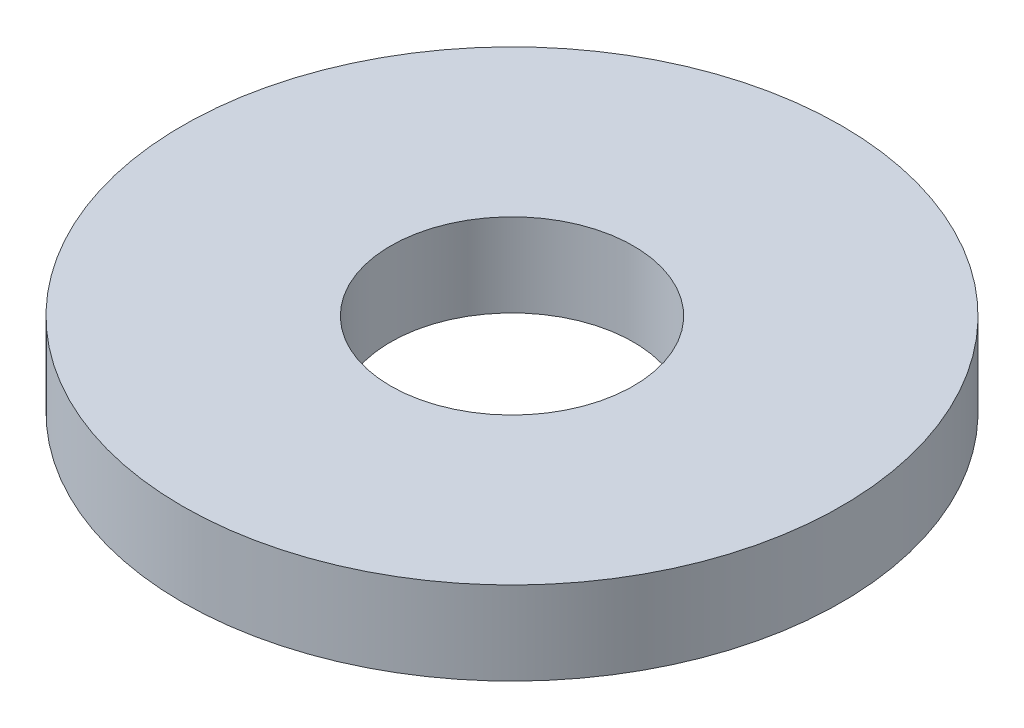
ISO-10303-21;
HEADER;
FILE_DESCRIPTION(('STEP AP214'),'2;1');
FILE_NAME('part.step','',(''),(''),'','','');
FILE_SCHEMA(('AUTOMOTIVE_DESIGN { 1 0 10303 214 1 1 1 1 }'));
ENDSEC;
DATA;
#1=APPLICATION_CONTEXT('core data for automotive mechanical design processes');
#2=APPLICATION_PROTOCOL_DEFINITION('international standard','automotive_design',2000,#1);
#3=PRODUCT_CONTEXT('',#1,'mechanical');
#4=PRODUCT('Part','Part','',(#3));
#5=PRODUCT_RELATED_PRODUCT_CATEGORY('part','',(#4));
#6=PRODUCT_DEFINITION_FORMATION('','',#4);
#7=PRODUCT_DEFINITION_CONTEXT('part definition',#1,'design');
#8=PRODUCT_DEFINITION('design','',#6,#7);
#9=PRODUCT_DEFINITION_SHAPE('','',#8);
#10=(LENGTH_UNIT() NAMED_UNIT(*) SI_UNIT(.MILLI.,.METRE.));
#11=(NAMED_UNIT(*) PLANE_ANGLE_UNIT() SI_UNIT($,.RADIAN.));
#12=(NAMED_UNIT(*) SI_UNIT($,.STERADIAN.) SOLID_ANGLE_UNIT());
#13=UNCERTAINTY_MEASURE_WITH_UNIT(LENGTH_MEASURE(1.E-05),#10,'distance_accuracy_value','');
#14=(GEOMETRIC_REPRESENTATION_CONTEXT(3) GLOBAL_UNCERTAINTY_ASSIGNED_CONTEXT((#13)) GLOBAL_UNIT_ASSIGNED_CONTEXT((#10,
#11,#12)) REPRESENTATION_CONTEXT('',''));
#15=CARTESIAN_POINT('',(0.,0.,0.));
#16=DIRECTION('',(0.,0.,1.));
#17=DIRECTION('',(1.,0.,0.));
#18=AXIS2_PLACEMENT_3D('',#15,#16,#17);
#19=CARTESIAN_POINT('',(0.,24.,0.));
#20=DIRECTION('',(0.,-1.,0.));
#21=DIRECTION('',(0.,0.,-1.));
#22=AXIS2_PLACEMENT_3D('',#19,#20,#21);
#23=CYLINDRICAL_SURFACE('',#22,95.);
#24=CARTESIAN_POINT('',(0.,24.,0.));
#25=DIRECTION('',(0.,1.,0.));
#26=DIRECTION('',(0.,0.,1.));
#27=AXIS2_PLACEMENT_3D('',#24,#25,#26);
#28=CIRCLE('',#27,95.);
#29=CARTESIAN_POINT('',(0.,24.,95.));
#30=VERTEX_POINT('',#29);
#31=EDGE_CURVE('E10',#30,#30,#28,.T.);
#32=ORIENTED_EDGE('',*,*,#31,.F.);
#33=EDGE_LOOP('',(#32));
#34=FACE_BOUND('',#33,.T.);
#35=CARTESIAN_POINT('',(0.,0.,0.));
#36=DIRECTION('',(0.,1.,0.));
#37=DIRECTION('',(0.,0.,1.));
#38=AXIS2_PLACEMENT_3D('',#35,#36,#37);
#39=CIRCLE('',#38,95.);
#40=CARTESIAN_POINT('',(0.,0.,95.));
#41=VERTEX_POINT('',#40);
#42=EDGE_CURVE('E37',#41,#41,#39,.T.);
#43=ORIENTED_EDGE('',*,*,#42,.T.);
#44=EDGE_LOOP('',(#43));
#45=FACE_BOUND('',#44,.T.);
#46=ADVANCED_FACE('F40',(#34,#45),#23,.T.);
#47=CARTESIAN_POINT('',(0.,24.,0.));
#48=DIRECTION('',(0.,1.,0.));
#49=DIRECTION('',(0.,0.,1.));
#50=AXIS2_PLACEMENT_3D('',#47,#48,#49);
#51=PLANE('',#50);
#52=CARTESIAN_POINT('',(0.,24.,0.));
#53=DIRECTION('',(0.,1.,0.));
#54=DIRECTION('',(0.,0.,1.));
#55=AXIS2_PLACEMENT_3D('',#52,#53,#54);
#56=CIRCLE('',#55,35.);
#57=CARTESIAN_POINT('',(0.,24.,35.));
#58=VERTEX_POINT('',#57);
#59=EDGE_CURVE('E50',#58,#58,#56,.T.);
#60=ORIENTED_EDGE('',*,*,#59,.F.);
#61=EDGE_LOOP('',(#60));
#62=FACE_BOUND('',#61,.T.);
#63=ORIENTED_EDGE('',*,*,#31,.T.);
#64=EDGE_LOOP('',(#63));
#65=FACE_BOUND('',#64,.T.);
#66=ADVANCED_FACE('F59',(#62,#65),#51,.T.);
#67=CARTESIAN_POINT('',(0.,0.,0.));
#68=DIRECTION('',(0.,1.,0.));
#69=DIRECTION('',(0.,0.,1.));
#70=AXIS2_PLACEMENT_3D('',#67,#68,#69);
#71=PLANE('',#70);
#72=CARTESIAN_POINT('',(0.,0.,0.));
#73=DIRECTION('',(0.,1.,0.));
#74=DIRECTION('',(0.,0.,1.));
#75=AXIS2_PLACEMENT_3D('',#72,#73,#74);
#76=CIRCLE('',#75,35.);
#77=CARTESIAN_POINT('',(0.,0.,35.));
#78=VERTEX_POINT('',#77);
#79=EDGE_CURVE('E47',#78,#78,#76,.T.);
#80=ORIENTED_EDGE('',*,*,#79,.T.);
#81=EDGE_LOOP('',(#80));
#82=FACE_BOUND('',#81,.T.);
#83=ORIENTED_EDGE('',*,*,#42,.F.);
#84=EDGE_LOOP('',(#83));
#85=FACE_BOUND('',#84,.T.);
#86=ADVANCED_FACE('F58',(#82,#85),#71,.F.);
#87=CARTESIAN_POINT('',(0.,24.,0.));
#88=DIRECTION('',(0.,-1.,0.));
#89=DIRECTION('',(0.,0.,-1.));
#90=AXIS2_PLACEMENT_3D('',#87,#88,#89);
#91=CYLINDRICAL_SURFACE('',#90,35.);
#92=ORIENTED_EDGE('',*,*,#59,.T.);
#93=EDGE_LOOP('',(#92));
#94=FACE_BOUND('',#93,.T.);
#95=ORIENTED_EDGE('',*,*,#79,.F.);
#96=EDGE_LOOP('',(#95));
#97=FACE_BOUND('',#96,.T.);
#98=ADVANCED_FACE('F54',(#94,#97),#91,.F.);
#99=CLOSED_SHELL('',(#46,#66,#86,#98));
#100=MANIFOLD_SOLID_BREP('B2',#99);
#101=ADVANCED_BREP_SHAPE_REPRESENTATION('',(#18,#100),#14);
#102=SHAPE_DEFINITION_REPRESENTATION(#9,#101);
ENDSEC;
END-ISO-10303-21;
